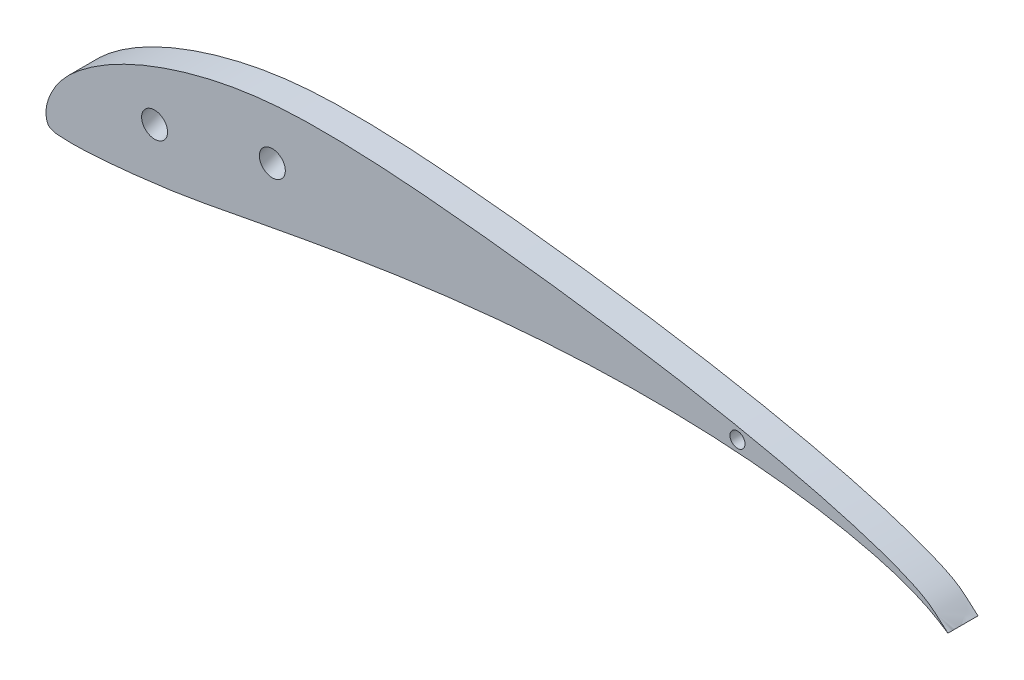
ISO-10303-21;
HEADER;
FILE_DESCRIPTION(('STEP AP214'),'2;1');
FILE_NAME('part.step','',(''),(''),'','','');
FILE_SCHEMA(('AUTOMOTIVE_DESIGN { 1 0 10303 214 1 1 1 1 }'));
ENDSEC;
DATA;
#1=APPLICATION_CONTEXT('core data for automotive mechanical design processes');
#2=APPLICATION_PROTOCOL_DEFINITION('international standard','automotive_design',2000,#1);
#3=PRODUCT_CONTEXT('',#1,'mechanical');
#4=PRODUCT('Part','Part','',(#3));
#5=PRODUCT_RELATED_PRODUCT_CATEGORY('part','',(#4));
#6=PRODUCT_DEFINITION_FORMATION('','',#4);
#7=PRODUCT_DEFINITION_CONTEXT('part definition',#1,'design');
#8=PRODUCT_DEFINITION('design','',#6,#7);
#9=PRODUCT_DEFINITION_SHAPE('','',#8);
#10=(LENGTH_UNIT() NAMED_UNIT(*) SI_UNIT(.MILLI.,.METRE.));
#11=(NAMED_UNIT(*) PLANE_ANGLE_UNIT() SI_UNIT($,.RADIAN.));
#12=(NAMED_UNIT(*) SI_UNIT($,.STERADIAN.) SOLID_ANGLE_UNIT());
#13=UNCERTAINTY_MEASURE_WITH_UNIT(LENGTH_MEASURE(1.E-05),#10,'distance_accuracy_value','');
#14=(GEOMETRIC_REPRESENTATION_CONTEXT(3) GLOBAL_UNCERTAINTY_ASSIGNED_CONTEXT((#13)) GLOBAL_UNIT_ASSIGNED_CONTEXT((#10,
#11,#12)) REPRESENTATION_CONTEXT('',''));
#15=CARTESIAN_POINT('',(0.,0.,0.));
#16=DIRECTION('',(0.,0.,1.));
#17=DIRECTION('',(1.,0.,0.));
#18=AXIS2_PLACEMENT_3D('',#15,#16,#17);
#19=CARTESIAN_POINT('',(0.900676601870566,3.33146790704091,75.));
#20=DIRECTION('',(0.,0.,-1.));
#21=DIRECTION('',(-1.,0.,0.));
#22=AXIS2_PLACEMENT_3D('',#19,#20,#21);
#23=PLANE('',#22);
#24=CARTESIAN_POINT('',(37.6424462791263,11.5072386040668,75.));
#25=DIRECTION('',(0.,0.,-1.));
#26=DIRECTION('',(-0.993803280370438,0.111153227235903,0.));
#27=AXIS2_PLACEMENT_3D('',#24,#25,#26);
#28=ELLIPSE('',#27,2.16077491266766,2.10000000000001);
#29=CARTESIAN_POINT('',(35.495061082775,11.7474157089401,75.));
#30=VERTEX_POINT('',#29);
#31=EDGE_CURVE('E67',#30,#30,#28,.T.);
#32=ORIENTED_EDGE('',*,*,#31,.T.);
#33=EDGE_LOOP('',(#32));
#34=FACE_BOUND('',#33,.T.);
#35=CARTESIAN_POINT('',(115.,10.3676422077244,75.));
#36=DIRECTION('',(0.,0.,-1.));
#37=DIRECTION('',(0.,1.,0.));
#38=AXIS2_PLACEMENT_3D('',#35,#36,#37);
#39=ELLIPSE('',#38,1.2502304023083,1.25);
#40=CARTESIAN_POINT('',(115.,11.6178726100327,75.));
#41=VERTEX_POINT('',#40);
#42=EDGE_CURVE('E71',#41,#41,#39,.T.);
#43=ORIENTED_EDGE('',*,*,#42,.T.);
#44=EDGE_LOOP('',(#43));
#45=FACE_BOUND('',#44,.T.);
#46=CARTESIAN_POINT('',(18.0612940095102,7.27979553568151,75.));
#47=DIRECTION('',(0.,0.,-1.));
#48=DIRECTION('',(-0.993803280370438,0.111153227235903,0.));
#49=AXIS2_PLACEMENT_3D('',#46,#47,#48);
#50=ELLIPSE('',#49,2.16077491266766,2.1);
#51=CARTESIAN_POINT('',(15.9139088131589,7.5199726405549,75.));
#52=VERTEX_POINT('',#51);
#53=EDGE_CURVE('E55',#52,#52,#50,.T.);
#54=ORIENTED_EDGE('',*,*,#53,.T.);
#55=EDGE_LOOP('',(#54));
#56=FACE_BOUND('',#55,.T.);
#57=CARTESIAN_POINT('',(150.,0.,75.));
#58=CARTESIAN_POINT('',(150.000899289152,0.00381819650752139,75.));
#59=CARTESIAN_POINT('',(149.507930169283,0.371377778407457,75.));
#60=CARTESIAN_POINT('',(149.091049020768,0.780692200444353,75.));
#61=CARTESIAN_POINT('',(148.165385918256,1.63564488717687,75.));
#62=CARTESIAN_POINT('',(147.073285762807,2.54518803078999,75.));
#63=CARTESIAN_POINT('',(145.579273929923,3.46224404255344,75.));
#64=CARTESIAN_POINT('',(143.721372273851,4.35111616153235,75.));
#65=CARTESIAN_POINT('',(141.478397693166,5.27886655467895,75.));
#66=CARTESIAN_POINT('',(138.853765182207,6.23258673383335,75.));
#67=CARTESIAN_POINT('',(135.85971864832,7.20554154204954,75.));
#68=CARTESIAN_POINT('',(132.511800063579,8.18928701155355,75.));
#69=CARTESIAN_POINT('',(128.828757145348,9.17920486900046,75.));
#70=CARTESIAN_POINT('',(124.830924819146,10.1662104195705,75.));
#71=CARTESIAN_POINT('',(120.54122319012,11.1431608499966,75.));
#72=CARTESIAN_POINT('',(115.985219841489,12.1039545564816,75.));
#73=CARTESIAN_POINT('',(111.190736161851,13.0436508102587,75.));
#74=CARTESIAN_POINT('',(106.185791668959,13.9506967600958,75.));
#75=CARTESIAN_POINT('',(101.001904956753,14.8237881075425,75.));
#76=CARTESIAN_POINT('',(95.6689490433944,15.6516948201271,75.));
#77=CARTESIAN_POINT('',(90.2214146874853,16.4360180876638,75.));
#78=CARTESIAN_POINT('',(84.6942136733632,17.1705453823488,75.));
#79=CARTESIAN_POINT('',(79.1273805633578,17.8529185629788,75.));
#80=CARTESIAN_POINT('',(73.5654214973004,18.4879403082002,75.));
#81=CARTESIAN_POINT('',(68.054377516833,19.0596198460297,75.));
#82=CARTESIAN_POINT('',(62.6391441800531,19.5572775987895,75.));
#83=CARTESIAN_POINT('',(57.35779940524,19.9529944989166,75.));
#84=CARTESIAN_POINT('',(52.2405056996451,20.2257080008233,75.));
#85=CARTESIAN_POINT('',(47.3157220885386,20.3444131036101,75.));
#86=CARTESIAN_POINT('',(42.6086861718548,20.3335787752035,75.));
#87=CARTESIAN_POINT('',(38.1281478975343,20.1046513112592,75.));
#88=CARTESIAN_POINT('',(33.8723652710563,19.6390793340002,75.));
#89=CARTESIAN_POINT('',(29.8240294835822,18.9800756122592,75.));
#90=CARTESIAN_POINT('',(25.982162907299,18.1258591702176,75.));
#91=CARTESIAN_POINT('',(22.3507285308284,17.1238704341562,75.));
#92=CARTESIAN_POINT('',(18.9450960578767,15.9918730111014,75.));
#93=CARTESIAN_POINT('',(15.7797567934298,14.7563611317165,75.));
#94=CARTESIAN_POINT('',(12.8743801617642,13.4239532815015,75.));
#95=CARTESIAN_POINT('',(10.238291416027,12.0217182709884,75.));
#96=CARTESIAN_POINT('',(7.88583461059793,10.5656076033478,75.));
#97=CARTESIAN_POINT('',(5.83176589681337,9.07535873582966,75.));
#98=CARTESIAN_POINT('',(4.0769434500407,7.5825739909971,75.));
#99=CARTESIAN_POINT('',(2.64680221041335,6.07094314969679,75.));
#100=CARTESIAN_POINT('',(1.54814866536494,4.55355888811498,75.));
#101=CARTESIAN_POINT('',(0.736478585984626,3.07725753828289,75.));
#102=CARTESIAN_POINT('',(0.216127101284425,1.67549317939585,75.));
#103=CARTESIAN_POINT('',(-0.032035919242502,0.381585183657673,75.));
#104=CARTESIAN_POINT('',(0.0154034725368893,-0.712842884515928,75.));
#105=CARTESIAN_POINT('',(0.296818428144351,-1.71669168240622,75.));
#106=CARTESIAN_POINT('',(1.34399590583567,-2.2153220143065,75.));
#107=CARTESIAN_POINT('',(2.75214635583259,-2.28571250716803,75.));
#108=CARTESIAN_POINT('',(4.67850051945847,-2.35412859107603,75.));
#109=CARTESIAN_POINT('',(7.10109213474685,-2.25049696083349,75.));
#110=CARTESIAN_POINT('',(9.99251237349676,-2.05951632249734,75.));
#111=CARTESIAN_POINT('',(13.3205931283223,-1.75315802660812,75.));
#112=CARTESIAN_POINT('',(17.0512775954276,-1.33837616882355,75.));
#113=CARTESIAN_POINT('',(21.1663777493917,-0.806236455276061,75.));
#114=CARTESIAN_POINT('',(25.6639152876827,-0.0620603139213689,75.));
#115=CARTESIAN_POINT('',(30.5657792465604,0.871378580307179,75.));
#116=CARTESIAN_POINT('',(35.8964372624993,1.88725938901887,75.));
#117=CARTESIAN_POINT('',(41.6298263636064,2.9598477369283,75.));
#118=CARTESIAN_POINT('',(47.7299218042866,4.04455437653433,75.));
#119=CARTESIAN_POINT('',(54.1519129709237,5.10060814991483,75.));
#120=CARTESIAN_POINT('',(60.8459682699352,6.09268798297526,75.));
#121=CARTESIAN_POINT('',(67.7543890329755,6.9843361398765,75.));
#122=CARTESIAN_POINT('',(74.8150435721905,7.74954211330217,75.));
#123=CARTESIAN_POINT('',(81.9612254877641,8.35386710869624,75.));
#124=CARTESIAN_POINT('',(89.1212177404963,8.78153799605541,75.));
#125=CARTESIAN_POINT('',(96.220212479205,9.01556347534524,75.));
#126=CARTESIAN_POINT('',(103.181194498136,9.04303469629456,75.));
#127=CARTESIAN_POINT('',(109.926502556761,8.86194901902542,75.));
#128=CARTESIAN_POINT('',(116.378899617892,8.47651792016937,75.));
#129=CARTESIAN_POINT('',(122.460796636297,7.89171254868704,75.));
#130=CARTESIAN_POINT('',(128.099790298758,7.12992514558223,75.));
#131=CARTESIAN_POINT('',(133.222466898318,6.21322885215876,75.));
#132=CARTESIAN_POINT('',(137.768772176685,5.17228657159243,75.));
#133=CARTESIAN_POINT('',(141.654931000593,4.05876887414132,75.));
#134=CARTESIAN_POINT('',(144.835255918468,2.87065969325588,75.));
#135=CARTESIAN_POINT('',(147.104253470448,1.78360851317507,75.));
#136=CARTESIAN_POINT('',(148.777054722266,0.778630866538671,75.));
#137=CARTESIAN_POINT('',(149.419672052869,0.38972272401338,75.));
#138=CARTESIAN_POINT('',(149.999082428381,-0.00389582009732438,75.));
#139=CARTESIAN_POINT('',(150.,0.,75.));
#140=B_SPLINE_CURVE_WITH_KNOTS('',3,(#57,#58,#59,#60,#61,#62,#63,#64,#65,#66,#67,#68,#69,#70,
#71,#72,#73,#74,#75,#76,#77,#78,#79,#80,#81,#82,#83,#84,#85,#86,#87,#88,#89,#90,#91,#92,#93,#94,
#95,#96,#97,#98,#99,#100,#101,#102,#103,#104,#105,#106,#107,#108,#109,#110,#111,#112,#113,#114,
#115,#116,#117,#118,#119,#120,#121,#122,#123,#124,#125,#126,#127,#128,#129,#130,#131,#132,#133,
#134,#135,#136,#137,#138,#139),.UNSPECIFIED.,.T.,.F.,(4,1,1,1,1,1,1,1,1,1,1,1,1,1,1,1,1,1,1,1,1,
1,1,1,1,1,1,1,1,1,1,1,1,1,1,1,1,1,1,1,1,1,1,1,1,1,1,1,1,1,1,1,1,1,1,1,1,1,1,1,1,1,1,1,1,1,1,1,1,
1,1,1,1,1,1,1,1,1,1,1,4),(0.,0.000979677557134127,0.0036488621677631,0.00748349851947815,
0.0120952771855933,0.0175255907768788,0.0240517799938711,0.0317830505527586,0.0406778280832618,
0.0507103007904779,0.0618332290621795,0.0739892504845854,0.0871181731906812,0.101145048769791,
0.115990637111827,0.131570421640589,0.147788379302961,0.164550916882416,0.181757895150531,
0.199311954944345,0.217095071712264,0.234990228463986,0.252856883122009,0.270540593729572,
0.287886779266045,0.304773437599674,0.321101419214061,0.336806063174811,0.351800032584037,
0.366031063392082,0.379615674919835,0.392652962879186,0.405170358707495,0.417171919049936,
0.428603516911185,0.439418959108259,0.449596586064162,0.459102079103161,0.467907877534646,
0.475988300736527,0.483308968746149,0.489874507816402,0.495803249719207,0.501149411695552,
0.50590307325604,0.510046768536663,0.513579310681042,0.516446926626751,0.5193500525909,
0.523823355179486,0.529973793997694,0.537715654387927,0.546967844488146,0.55763736682571,
0.569620481096633,0.582804124215616,0.597246960791632,0.613135036654701,0.630443600329816,
0.649056123608545,0.668822256795696,0.689594964002684,0.711189650864602,0.733426688964389,
0.756094117504156,0.778988553684861,0.801889682684955,0.824566597829707,0.846792284880412,
0.868338290507787,0.888978162959066,0.908492011340558,0.926658767581933,0.943286193042322,
0.958169210358795,0.971135821634751,0.981955623079976,0.990251791025976,0.995852565249962,
0.999000405686701,1.),.UNSPECIFIED.);
#141=CARTESIAN_POINT('',(150.,0.,75.));
#142=VERTEX_POINT('',#141);
#143=EDGE_CURVE('E10',#142,#142,#140,.T.);
#144=ORIENTED_EDGE('',*,*,#143,.T.);
#145=EDGE_LOOP('',(#144));
#146=FACE_BOUND('',#145,.T.);
#147=ADVANCED_FACE('F39',(#34,#45,#56,#146),#23,.F.);
#148=CARTESIAN_POINT('',(0.900676601870566,3.33146790704091,70.));
#149=DIRECTION('',(0.,0.,-1.));
#150=DIRECTION('',(-1.,0.,0.));
#151=AXIS2_PLACEMENT_3D('',#148,#149,#150);
#152=PLANE('',#151);
#153=CARTESIAN_POINT('',(36.4383600118256,11.6419112069093,70.));
#154=DIRECTION('',(0.,0.,-1.));
#155=DIRECTION('',(-0.993803280370438,0.111153227235903,0.));
#156=AXIS2_PLACEMENT_3D('',#153,#154,#155);
#157=ELLIPSE('',#156,2.16077491266766,2.10000000000001);
#158=CARTESIAN_POINT('',(34.2909748154744,11.8820883117827,70.));
#159=VERTEX_POINT('',#158);
#160=EDGE_CURVE('E58',#159,#159,#157,.T.);
#161=ORIENTED_EDGE('',*,*,#160,.F.);
#162=EDGE_LOOP('',(#161));
#163=FACE_BOUND('',#162,.T.);
#164=CARTESIAN_POINT('',(115.,10.4636471122631,70.));
#165=DIRECTION('',(0.,0.,-1.));
#166=DIRECTION('',(0.,1.,0.));
#167=AXIS2_PLACEMENT_3D('',#164,#165,#166);
#168=ELLIPSE('',#167,1.2502304023083,1.25);
#169=CARTESIAN_POINT('',(115.,11.7138775145714,70.));
#170=VERTEX_POINT('',#169);
#171=EDGE_CURVE('E68',#170,#170,#168,.T.);
#172=ORIENTED_EDGE('',*,*,#171,.F.);
#173=EDGE_LOOP('',(#172));
#174=FACE_BOUND('',#173,.T.);
#175=CARTESIAN_POINT('',(16.8572077422095,7.41446813852401,70.));
#176=DIRECTION('',(0.,0.,-1.));
#177=DIRECTION('',(-0.993803280370438,0.111153227235903,0.));
#178=AXIS2_PLACEMENT_3D('',#175,#176,#177);
#179=ELLIPSE('',#178,2.16077491266766,2.1);
#180=CARTESIAN_POINT('',(14.7098225458583,7.6546452433974,70.));
#181=VERTEX_POINT('',#180);
#182=EDGE_CURVE('E72',#181,#181,#179,.T.);
#183=ORIENTED_EDGE('',*,*,#182,.F.);
#184=EDGE_LOOP('',(#183));
#185=FACE_BOUND('',#184,.T.);
#186=CARTESIAN_POINT('',(150.,0.,70.));
#187=CARTESIAN_POINT('',(150.000899289152,0.00381819650752139,70.));
#188=CARTESIAN_POINT('',(149.507930169283,0.371377778407457,70.));
#189=CARTESIAN_POINT('',(149.091049020768,0.780692200444353,70.));
#190=CARTESIAN_POINT('',(148.165385918256,1.63564488717687,70.));
#191=CARTESIAN_POINT('',(147.073285762807,2.54518803078999,70.));
#192=CARTESIAN_POINT('',(145.579273929923,3.46224404255344,70.));
#193=CARTESIAN_POINT('',(143.721372273851,4.35111616153235,70.));
#194=CARTESIAN_POINT('',(141.478397693166,5.27886655467895,70.));
#195=CARTESIAN_POINT('',(138.853765182207,6.23258673383335,70.));
#196=CARTESIAN_POINT('',(135.85971864832,7.20554154204954,70.));
#197=CARTESIAN_POINT('',(132.511800063579,8.18928701155355,70.));
#198=CARTESIAN_POINT('',(128.828757145348,9.17920486900046,70.));
#199=CARTESIAN_POINT('',(124.830924819146,10.1662104195705,70.));
#200=CARTESIAN_POINT('',(120.54122319012,11.1431608499966,70.));
#201=CARTESIAN_POINT('',(115.985219841489,12.1039545564816,70.));
#202=CARTESIAN_POINT('',(111.190736161851,13.0436508102587,70.));
#203=CARTESIAN_POINT('',(106.185791668959,13.9506967600958,70.));
#204=CARTESIAN_POINT('',(101.001904956753,14.8237881075425,70.));
#205=CARTESIAN_POINT('',(95.6689490433944,15.6516948201271,70.));
#206=CARTESIAN_POINT('',(90.2214146874853,16.4360180876638,70.));
#207=CARTESIAN_POINT('',(84.6942136733632,17.1705453823488,70.));
#208=CARTESIAN_POINT('',(79.1273805633578,17.8529185629788,70.));
#209=CARTESIAN_POINT('',(73.5654214973004,18.4879403082002,70.));
#210=CARTESIAN_POINT('',(68.054377516833,19.0596198460297,70.));
#211=CARTESIAN_POINT('',(62.6391441800531,19.5572775987895,70.));
#212=CARTESIAN_POINT('',(57.35779940524,19.9529944989166,70.));
#213=CARTESIAN_POINT('',(52.2405056996451,20.2257080008233,70.));
#214=CARTESIAN_POINT('',(47.3157220885386,20.3444131036101,70.));
#215=CARTESIAN_POINT('',(42.6086861718548,20.3335787752035,70.));
#216=CARTESIAN_POINT('',(38.1281478975343,20.1046513112592,70.));
#217=CARTESIAN_POINT('',(33.8723652710563,19.6390793340002,70.));
#218=CARTESIAN_POINT('',(29.8240294835822,18.9800756122592,70.));
#219=CARTESIAN_POINT('',(25.982162907299,18.1258591702176,70.));
#220=CARTESIAN_POINT('',(22.3507285308284,17.1238704341562,70.));
#221=CARTESIAN_POINT('',(18.9450960578767,15.9918730111014,70.));
#222=CARTESIAN_POINT('',(15.7797567934298,14.7563611317165,70.));
#223=CARTESIAN_POINT('',(12.8743801617642,13.4239532815015,70.));
#224=CARTESIAN_POINT('',(10.238291416027,12.0217182709884,70.));
#225=CARTESIAN_POINT('',(7.88583461059793,10.5656076033478,70.));
#226=CARTESIAN_POINT('',(5.83176589681337,9.07535873582966,70.));
#227=CARTESIAN_POINT('',(4.0769434500407,7.5825739909971,70.));
#228=CARTESIAN_POINT('',(2.64680221041335,6.07094314969679,70.));
#229=CARTESIAN_POINT('',(1.54814866536494,4.55355888811498,70.));
#230=CARTESIAN_POINT('',(0.736478585984626,3.07725753828289,70.));
#231=CARTESIAN_POINT('',(0.216127101284425,1.67549317939585,70.));
#232=CARTESIAN_POINT('',(-0.032035919242502,0.381585183657673,70.));
#233=CARTESIAN_POINT('',(0.0154034725368893,-0.712842884515928,70.));
#234=CARTESIAN_POINT('',(0.296818428144351,-1.71669168240622,70.));
#235=CARTESIAN_POINT('',(1.34399590583567,-2.2153220143065,70.));
#236=CARTESIAN_POINT('',(2.75214635583259,-2.28571250716803,70.));
#237=CARTESIAN_POINT('',(4.67850051945847,-2.35412859107603,70.));
#238=CARTESIAN_POINT('',(7.10109213474685,-2.25049696083349,70.));
#239=CARTESIAN_POINT('',(9.99251237349676,-2.05951632249734,70.));
#240=CARTESIAN_POINT('',(13.3205931283223,-1.75315802660812,70.));
#241=CARTESIAN_POINT('',(17.0512775954276,-1.33837616882355,70.));
#242=CARTESIAN_POINT('',(21.1663777493917,-0.806236455276061,70.));
#243=CARTESIAN_POINT('',(25.6639152876827,-0.0620603139213689,70.));
#244=CARTESIAN_POINT('',(30.5657792465604,0.871378580307179,70.));
#245=CARTESIAN_POINT('',(35.8964372624993,1.88725938901887,70.));
#246=CARTESIAN_POINT('',(41.6298263636064,2.9598477369283,70.));
#247=CARTESIAN_POINT('',(47.7299218042866,4.04455437653433,70.));
#248=CARTESIAN_POINT('',(54.1519129709237,5.10060814991483,70.));
#249=CARTESIAN_POINT('',(60.8459682699352,6.09268798297526,70.));
#250=CARTESIAN_POINT('',(67.7543890329755,6.9843361398765,70.));
#251=CARTESIAN_POINT('',(74.8150435721905,7.74954211330217,70.));
#252=CARTESIAN_POINT('',(81.9612254877641,8.35386710869624,70.));
#253=CARTESIAN_POINT('',(89.1212177404963,8.78153799605541,70.));
#254=CARTESIAN_POINT('',(96.220212479205,9.01556347534524,70.));
#255=CARTESIAN_POINT('',(103.181194498136,9.04303469629456,70.));
#256=CARTESIAN_POINT('',(109.926502556761,8.86194901902542,70.));
#257=CARTESIAN_POINT('',(116.378899617892,8.47651792016937,70.));
#258=CARTESIAN_POINT('',(122.460796636297,7.89171254868704,70.));
#259=CARTESIAN_POINT('',(128.099790298758,7.12992514558223,70.));
#260=CARTESIAN_POINT('',(133.222466898318,6.21322885215876,70.));
#261=CARTESIAN_POINT('',(137.768772176685,5.17228657159243,70.));
#262=CARTESIAN_POINT('',(141.654931000593,4.05876887414132,70.));
#263=CARTESIAN_POINT('',(144.835255918468,2.87065969325588,70.));
#264=CARTESIAN_POINT('',(147.104253470448,1.78360851317507,70.));
#265=CARTESIAN_POINT('',(148.777054722266,0.778630866538671,70.));
#266=CARTESIAN_POINT('',(149.419672052869,0.38972272401338,70.));
#267=CARTESIAN_POINT('',(149.999082428381,-0.00389582009732438,70.));
#268=CARTESIAN_POINT('',(150.,0.,70.));
#269=B_SPLINE_CURVE_WITH_KNOTS('',3,(#186,#187,#188,#189,#190,#191,#192,#193,#194,#195,#196,
#197,#198,#199,#200,#201,#202,#203,#204,#205,#206,#207,#208,#209,#210,#211,#212,#213,#214,#215,
#216,#217,#218,#219,#220,#221,#222,#223,#224,#225,#226,#227,#228,#229,#230,#231,#232,#233,#234,
#235,#236,#237,#238,#239,#240,#241,#242,#243,#244,#245,#246,#247,#248,#249,#250,#251,#252,#253,
#254,#255,#256,#257,#258,#259,#260,#261,#262,#263,#264,#265,#266,#267,#268),.UNSPECIFIED.,.T.,
.F.,(4,1,1,1,1,1,1,1,1,1,1,1,1,1,1,1,1,1,1,1,1,1,1,1,1,1,1,1,1,1,1,1,1,1,1,1,1,1,1,1,1,1,1,1,1,
1,1,1,1,1,1,1,1,1,1,1,1,1,1,1,1,1,1,1,1,1,1,1,1,1,1,1,1,1,1,1,1,1,1,1,4),(0.,
0.000979677557134127,0.0036488621677631,0.00748349851947815,0.0120952771855933,
0.0175255907768788,0.0240517799938711,0.0317830505527586,0.0406778280832618,0.0507103007904779,
0.0618332290621795,0.0739892504845854,0.0871181731906812,0.101145048769791,0.115990637111827,
0.131570421640589,0.147788379302961,0.164550916882416,0.181757895150531,0.199311954944345,
0.217095071712264,0.234990228463986,0.252856883122009,0.270540593729572,0.287886779266045,
0.304773437599674,0.321101419214061,0.336806063174811,0.351800032584037,0.366031063392082,
0.379615674919835,0.392652962879186,0.405170358707495,0.417171919049936,0.428603516911185,
0.439418959108259,0.449596586064162,0.459102079103161,0.467907877534646,0.475988300736527,
0.483308968746149,0.489874507816402,0.495803249719207,0.501149411695552,0.50590307325604,
0.510046768536663,0.513579310681042,0.516446926626751,0.5193500525909,0.523823355179486,
0.529973793997694,0.537715654387927,0.546967844488146,0.55763736682571,0.569620481096633,
0.582804124215616,0.597246960791632,0.613135036654701,0.630443600329816,0.649056123608545,
0.668822256795696,0.689594964002684,0.711189650864602,0.733426688964389,0.756094117504156,
0.778988553684861,0.801889682684955,0.824566597829707,0.846792284880412,0.868338290507787,
0.888978162959066,0.908492011340558,0.926658767581933,0.943286193042322,0.958169210358795,
0.971135821634751,0.981955623079976,0.990251791025976,0.995852565249962,0.999000405686701,1.),.UNSPECIFIED.);
#270=CARTESIAN_POINT('',(150.,0.,70.));
#271=VERTEX_POINT('',#270);
#272=EDGE_CURVE('E49',#271,#271,#269,.T.);
#273=ORIENTED_EDGE('',*,*,#272,.F.);
#274=EDGE_LOOP('',(#273));
#275=FACE_BOUND('',#274,.T.);
#276=ADVANCED_FACE('F89',(#163,#174,#185,#275),#152,.T.);
#277=CARTESIAN_POINT('',(4.74743716557837E-05,0.0212217477680842,70.));
#278=CARTESIAN_POINT('',(2.43218950075959E-07,0.00151801072699147,75.));
#279=CARTESIAN_POINT('',(-0.00112273960208763,-0.240509349931553,70.));
#280=CARTESIAN_POINT('',(-8.36382857550691E-05,-0.260260989227729,75.));
#281=CARTESIAN_POINT('',(0.019819482796319,-0.509746820953582,70.));
#282=CARTESIAN_POINT('',(0.0220691312859094,-0.529626434632505,75.));
#283=CARTESIAN_POINT('',(0.119184676616905,-1.08050933216311,70.));
#284=CARTESIAN_POINT('',(0.124168787272293,-1.10082486014907,75.));
#285=CARTESIAN_POINT('',(0.207092317778644,-1.39662536668551,70.));
#286=CARTESIAN_POINT('',(0.215128171292299,-1.41516077802882,75.));
#287=CARTESIAN_POINT('',(0.579384512224486,-1.84820624477975,70.));
#288=CARTESIAN_POINT('',(0.596407747108545,-1.85934593608463,75.));
#289=CARTESIAN_POINT('',(0.880268400151804,-1.99451073350984,70.));
#290=CARTESIAN_POINT('',(0.899674660276473,-2.00262515254175,75.));
#291=CARTESIAN_POINT('',(1.63314221976803,-2.22808456724478,70.));
#292=CARTESIAN_POINT('',(1.65278345123915,-2.23075765721703,75.));
#293=CARTESIAN_POINT('',(2.10531268849063,-2.25337864636237,70.));
#294=CARTESIAN_POINT('',(2.12504806325617,-2.25432425958478,75.));
#295=CARTESIAN_POINT('',(3.20813448224813,-2.30185168554796,70.));
#296=CARTESIAN_POINT('',(3.22796887512608,-2.30261174305102,75.));
#297=CARTESIAN_POINT('',(3.85984142993748,-2.32505322683704,70.));
#298=CARTESIAN_POINT('',(3.87969883295583,-2.32552709888637,75.));
#299=CARTESIAN_POINT('',(5.30905967109101,-2.32686380730579,70.));
#300=CARTESIAN_POINT('',(5.32888983415117,-2.32630677226489,75.));
#301=CARTESIAN_POINT('',(6.12603475119775,-2.29220716308117,70.));
#302=CARTESIAN_POINT('',(6.14585283071528,-2.29128887606364,75.));
#303=CARTESIAN_POINT('',(7.897076903589,-2.1978372300651,70.));
#304=CARTESIAN_POINT('',(7.91687590840157,-2.1966137847566,75.));
#305=CARTESIAN_POINT('',(8.87072687478084,-2.13361115926643,70.));
#306=CARTESIAN_POINT('',(8.89051449006361,-2.13222411147324,75.));
#307=CARTESIAN_POINT('',(10.9444572798532,-1.97179494831067,70.));
#308=CARTESIAN_POINT('',(10.9642187073188,-1.97006828368312,75.));
#309=CARTESIAN_POINT('',(12.0640165377712,-1.86882909690212,70.));
#310=CARTESIAN_POINT('',(12.0837646316949,-1.86695167644748,75.));
#311=CARTESIAN_POINT('',(14.4181782599238,-1.63106024733171,70.));
#312=CARTESIAN_POINT('',(14.4379000155033,-1.62893454148985,75.));
#313=CARTESIAN_POINT('',(15.6722417726821,-1.49169898278795,70.));
#314=CARTESIAN_POINT('',(15.6919500979741,-1.48945086723688,75.));
#315=CARTESIAN_POINT('',(18.2830978903162,-1.17902194188272,70.));
#316=CARTESIAN_POINT('',(18.3027795094964,-1.1765395560706,75.));
#317=CARTESIAN_POINT('',(19.659331594069,-1.00111849444679,70.));
#318=CARTESIAN_POINT('',(19.6789899911428,-0.998463299623442,75.));
#319=CARTESIAN_POINT('',(22.5159340228966,-0.582810318429365,70.));
#320=CARTESIAN_POINT('',(22.535525103531,-0.579693199933605,75.));
#321=CARTESIAN_POINT('',(24.0152456534623,-0.334854169740744,70.));
#322=CARTESIAN_POINT('',(24.0348050702323,-0.331540266410314,75.));
#323=CARTESIAN_POINT('',(27.137005063211,0.218538894069538,70.));
#324=CARTESIAN_POINT('',(27.1565062632083,0.222166764067372,75.));
#325=CARTESIAN_POINT('',(28.7783192773168,0.531000986974172,70.));
#326=CARTESIAN_POINT('',(28.7978049931779,0.534712021920137,75.));
#327=CARTESIAN_POINT('',(32.1875173057283,1.18043897150666,70.));
#328=CARTESIAN_POINT('',(32.2070024236022,1.18415181081348,75.));
#329=CARTESIAN_POINT('',(33.974894993898,1.5210648389345,70.));
#330=CARTESIAN_POINT('',(33.9943819925571,1.52476755234728,75.));
#331=CARTESIAN_POINT('',(37.6654788356257,2.21819553627208,70.));
#332=CARTESIAN_POINT('',(37.6849742459291,2.22185449400859,75.));
#333=CARTESIAN_POINT('',(39.5882653969388,2.57791752675444,70.));
#334=CARTESIAN_POINT('',(39.6077682160076,2.58153673350815,75.));
#335=CARTESIAN_POINT('',(43.5362634662411,3.29881543523057,70.));
#336=CARTESIAN_POINT('',(43.5557876972618,3.30231828784932,75.));
#337=CARTESIAN_POINT('',(45.5811874470931,3.66247077691486,70.));
#338=CARTESIAN_POINT('',(45.6007243522082,3.66590210595217,75.));
#339=CARTESIAN_POINT('',(49.7598663880073,4.37832052398629,70.));
#340=CARTESIAN_POINT('',(49.7794324150101,4.38158277752034,75.));
#341=CARTESIAN_POINT('',(51.9134068843971,4.73250069880329,70.));
#342=CARTESIAN_POINT('',(51.932988420593,4.73566851237646,75.));
#343=CARTESIAN_POINT('',(56.2912253154964,5.41760673325003,70.));
#344=CARTESIAN_POINT('',(56.3108393927093,5.42056776608816,75.));
#345=CARTESIAN_POINT('',(58.5353136827066,5.7502417803727,70.));
#346=CARTESIAN_POINT('',(58.5549445521347,5.75308912804966,75.));
#347=CARTESIAN_POINT('',(63.0762758945049,6.38048309827859,70.));
#348=CARTESIAN_POINT('',(63.0959409678148,6.38308488813707,75.));
#349=CARTESIAN_POINT('',(65.3929720461025,6.67955547056852,70.));
#350=CARTESIAN_POINT('',(65.4126537887238,6.68202818177056,75.));
#351=CARTESIAN_POINT('',(70.0570395809351,7.23381966587949,70.));
#352=CARTESIAN_POINT('',(70.0767533189189,7.2360248486505,75.));
#353=CARTESIAN_POINT('',(72.4242171054296,7.49043374259394,70.));
#354=CARTESIAN_POINT('',(72.4439464821597,7.49249366602081,75.));
#355=CARTESIAN_POINT('',(77.1679041294983,7.94843557094162,70.));
#356=CARTESIAN_POINT('',(77.187663648563,7.95018542656586,75.));
#357=CARTESIAN_POINT('',(79.5642117073992,8.15116091413076,70.));
#358=CARTESIAN_POINT('',(79.5839847559303,8.15275086262461,75.));
#359=CARTESIAN_POINT('',(84.3420423675224,8.49599275531487,70.));
#360=CARTESIAN_POINT('',(84.3618390214406,8.49725728062864,75.));
#361=CARTESIAN_POINT('',(86.743349825568,8.63950643438546,70.));
#362=CARTESIAN_POINT('',(86.7631565958988,8.64060037919165,75.));
#363=CARTESIAN_POINT('',(91.50573285764,8.86005778276219,70.));
#364=CARTESIAN_POINT('',(91.525556236114,8.86079942524676,75.));
#365=CARTESIAN_POINT('',(93.886592198654,8.9386333430184,70.));
#366=CARTESIAN_POINT('',(93.9064215866892,8.93918985373245,75.));
#367=CARTESIAN_POINT('',(98.5825628060966,9.02479118734688,70.));
#368=CARTESIAN_POINT('',(98.6023995321108,9.0249646757355,75.));
#369=CARTESIAN_POINT('',(100.917478562586,9.03410103715525,70.));
#370=CARTESIAN_POINT('',(100.93731597522,9.03407567156421,75.));
#371=CARTESIAN_POINT('',(105.495490608155,8.98080418655828,70.));
#372=CARTESIAN_POINT('',(105.515323560821,8.98037227398911,75.));
#373=CARTESIAN_POINT('',(107.758443173884,8.92015310671063,70.));
#374=CARTESIAN_POINT('',(107.778270348389,8.91950961025333,75.));
#375=CARTESIAN_POINT('',(112.166520378994,8.72803584356576,70.));
#376=CARTESIAN_POINT('',(112.186329324868,8.72695926154402,75.));
#377=CARTESIAN_POINT('',(114.331590573824,8.59881302493079,70.));
#378=CARTESIAN_POINT('',(114.351385493185,8.59750696782519,75.));
#379=CARTESIAN_POINT('',(118.518134656754,8.2707023550595,70.));
#380=CARTESIAN_POINT('',(118.537892601677,8.26891974971542,75.));
#381=CARTESIAN_POINT('',(120.559710289388,8.07451168256909,70.));
#382=CARTESIAN_POINT('',(120.579444429723,8.07248154567679,75.));
#383=CARTESIAN_POINT('',(124.473865285723,7.61963747204167,70.));
#384=CARTESIAN_POINT('',(124.493542637793,7.61710321405346,75.));
#385=CARTESIAN_POINT('',(126.366751735266,7.3640461653578,70.));
#386=CARTESIAN_POINT('',(126.38639170462,7.36124337544054,75.));
#387=CARTESIAN_POINT('',(129.96009246219,6.79688861046591,70.));
#388=CARTESIAN_POINT('',(129.979642421403,6.79352806106568,75.));
#389=CARTESIAN_POINT('',(131.681231543166,6.48903090795955,70.));
#390=CARTESIAN_POINT('',(131.700729701386,6.48537079566455,75.));
#391=CARTESIAN_POINT('',(134.909138316615,5.82688663340589,70.));
#392=CARTESIAN_POINT('',(134.928522774193,5.82260270950678,75.));
#393=CARTESIAN_POINT('',(136.436913270557,5.47723491145318,70.));
#394=CARTESIAN_POINT('',(136.456212440797,5.47262008515733,75.));
#395=CARTESIAN_POINT('',(139.251731046066,4.74719423331289,70.));
#396=CARTESIAN_POINT('',(139.270813564085,4.74190023306091,75.));
#397=CARTESIAN_POINT('',(140.561230315296,4.37215160603077,70.));
#398=CARTESIAN_POINT('',(140.580214746998,4.36641353842299,75.));
#399=CARTESIAN_POINT('',(142.927747913038,3.58301591792542,70.));
#400=CARTESIAN_POINT('',(142.946560143737,3.57624067878499,75.));
#401=CARTESIAN_POINT('',(144.006604721327,3.1802280928685,70.));
#402=CARTESIAN_POINT('',(144.025114053223,3.17296527594395,75.));
#403=CARTESIAN_POINT('',(145.816721760686,2.40016174763412,70.));
#404=CARTESIAN_POINT('',(145.834308816422,2.39202469837214,75.));
#405=CARTESIAN_POINT('',(146.58430737447,2.03270883358698,70.));
#406=CARTESIAN_POINT('',(146.601932904546,2.02381116929534,75.));
#407=CARTESIAN_POINT('',(147.906224894408,1.30151650415205,70.));
#408=CARTESIAN_POINT('',(147.924647409842,1.29073611148914,75.));
#409=CARTESIAN_POINT('',(148.461925584482,0.967952663693584,70.));
#410=CARTESIAN_POINT('',(148.479194496374,0.957566023990856,75.));
#411=CARTESIAN_POINT('',(149.137197461517,0.56066460008055,70.));
#412=CARTESIAN_POINT('',(149.150427929324,0.552667647823261,75.));
#413=CARTESIAN_POINT('',(149.349615892021,0.432120291104139,70.));
#414=CARTESIAN_POINT('',(149.365705728599,0.421876558480458,75.));
#415=CARTESIAN_POINT('',(149.842991556696,0.102064400592599,70.));
#416=CARTESIAN_POINT('',(149.868254616503,0.0849811745454894,75.));
#417=CARTESIAN_POINT('',(149.990263602918,0.00209518970493609,70.));
#418=CARTESIAN_POINT('',(150.007405941045,-0.00924692993429299,75.));
#419=CARTESIAN_POINT('',(150.008816460412,-0.00239274122793016,70.));
#420=CARTESIAN_POINT('',(149.992370913954,0.0101769843010658,75.));
#421=CARTESIAN_POINT('',(149.877071121162,0.0961449322391688,70.));
#422=CARTESIAN_POINT('',(149.852918329683,0.114390763543264,75.));
#423=CARTESIAN_POINT('',(149.464141506951,0.415880339845763,70.));
#424=CARTESIAN_POINT('',(149.449839038889,0.428414508294238,75.));
#425=CARTESIAN_POINT('',(149.308180538242,0.567501793784408,70.));
#426=CARTESIAN_POINT('',(149.296899889218,0.578449074613866,75.));
#427=CARTESIAN_POINT('',(148.878240582451,0.9771216951931,70.));
#428=CARTESIAN_POINT('',(148.863513068381,0.990846924440424,75.));
#429=CARTESIAN_POINT('',(148.554693407981,1.2760761808063,70.));
#430=CARTESIAN_POINT('',(148.53905621053,1.29031076731651,75.));
#431=CARTESIAN_POINT('',(147.873695417601,1.87831188357688,70.));
#432=CARTESIAN_POINT('',(147.858631616233,1.89112170474412,75.));
#433=CARTESIAN_POINT('',(147.505620049167,2.18512335728402,70.));
#434=CARTESIAN_POINT('',(147.490378971826,2.19723634063155,75.));
#435=CARTESIAN_POINT('',(146.668416020911,2.793110406897,70.));
#436=CARTESIAN_POINT('',(146.65173558688,2.80394443056235,75.));
#437=CARTESIAN_POINT('',(146.173452270119,3.09752483019978,70.));
#438=CARTESIAN_POINT('',(146.156253975643,3.10771093932195,75.));
#439=CARTESIAN_POINT('',(145.078592601998,3.70135926379378,70.));
#440=CARTESIAN_POINT('',(145.060867445771,3.71026420473721,75.));
#441=CARTESIAN_POINT('',(144.456916149872,3.99921139760471,70.));
#442=CARTESIAN_POINT('',(144.438971784858,4.0076133247128,75.));
#443=CARTESIAN_POINT('',(143.101263496418,4.60739762325484,70.));
#444=CARTESIAN_POINT('',(143.083003507956,4.61516145149312,75.));
#445=CARTESIAN_POINT('',(142.346233845258,4.91990781380706,70.));
#446=CARTESIAN_POINT('',(142.327840606885,4.92736930256842,75.));
#447=CARTESIAN_POINT('',(140.729601095307,5.55079332390628,70.));
#448=CARTESIAN_POINT('',(140.711009841666,5.55771446049363,75.));
#449=CARTESIAN_POINT('',(139.847715115635,5.87141232003577,70.));
#450=CARTESIAN_POINT('',(139.82903502787,5.87808582271422,75.));
#451=CARTESIAN_POINT('',(137.980074126072,6.51637680864895,70.));
#452=CARTESIAN_POINT('',(137.961245420056,6.52262277174545,75.));
#453=CARTESIAN_POINT('',(136.974239986987,6.84336317139224,70.));
#454=CARTESIAN_POINT('',(136.955345343132,6.84940900016865,75.));
#455=CARTESIAN_POINT('',(134.864078473324,7.49799488059283,70.));
#456=CARTESIAN_POINT('',(134.845074480002,7.50368248498958,75.));
#457=CARTESIAN_POINT('',(133.739868567956,7.82843390331864,70.));
#458=CARTESIAN_POINT('',(133.72081564968,7.83395547394536,75.));
#459=CARTESIAN_POINT('',(131.399347588318,8.48820538510887,70.));
#460=CARTESIAN_POINT('',(131.380211948477,8.49343206424061,75.));
#461=CARTESIAN_POINT('',(130.163272899682,8.82051749945627,70.));
#462=CARTESIAN_POINT('',(130.144099175705,8.82560304313582,75.));
#463=CARTESIAN_POINT('',(127.605366857732,9.48116886195693,70.));
#464=CARTESIAN_POINT('',(127.586125782323,9.48599213583512,75.));
#465=CARTESIAN_POINT('',(126.263813496153,9.81245144166507,70.));
#466=CARTESIAN_POINT('',(126.244541407456,9.81714948273394,75.));
#467=CARTESIAN_POINT('',(123.502916661109,10.4685915050954,70.));
#468=CARTESIAN_POINT('',(123.483589534959,10.4730568857463,75.));
#469=CARTESIAN_POINT('',(122.063885623392,10.7963848156185,70.));
#470=CARTESIAN_POINT('',(122.044533104926,10.8007389938694,75.));
#471=CARTESIAN_POINT('',(119.116507533003,11.4435561837941,70.));
#472=CARTESIAN_POINT('',(119.097109701728,11.4477030210453,75.));
#473=CARTESIAN_POINT('',(117.588494196237,11.7658477132825,70.));
#474=CARTESIAN_POINT('',(117.569075414625,11.7698955043913,75.));
#475=CARTESIAN_POINT('',(114.472204487185,12.4004489205718,70.));
#476=CARTESIAN_POINT('',(114.452748128324,12.4043118053751,75.));
#477=CARTESIAN_POINT('',(112.864274180393,12.715645228916,70.));
#478=CARTESIAN_POINT('',(112.844799561246,12.7194149034793,75.));
#479=CARTESIAN_POINT('',(109.597983552103,13.3322562656283,70.));
#480=CARTESIAN_POINT('',(109.578474119769,13.3358410148499,75.));
#481=CARTESIAN_POINT('',(107.919956084657,13.6364141917587,70.));
#482=CARTESIAN_POINT('',(107.900430747387,13.6399115488247,75.));
#483=CARTESIAN_POINT('',(104.523664818382,14.2305964391417,70.));
#484=CARTESIAN_POINT('',(104.50411127805,14.2339322318541,75.));
#485=CARTESIAN_POINT('',(102.785741730872,14.5233470409827,70.));
#486=CARTESIAN_POINT('',(102.766174269226,14.5266000163613,75.));
#487=CARTESIAN_POINT('',(99.2799565468954,15.0910657039681,70.));
#488=CARTESIAN_POINT('',(99.2603620283589,15.0941513177577,75.));
#489=CARTESIAN_POINT('',(97.4924186048122,15.3686130330997,70.));
#490=CARTESIAN_POINT('',(97.4728118576367,15.3716202223627,75.));
#491=CARTESIAN_POINT('',(93.8980929646453,15.9066212349424,70.));
#492=CARTESIAN_POINT('',(93.8784647680927,15.9094845623348,75.));
#493=CARTESIAN_POINT('',(92.0716303312258,16.1696283626,70.));
#494=CARTESIAN_POINT('',(92.051991770946,16.1724196561489,75.));
#495=CARTESIAN_POINT('',(88.4118515340825,16.6764600453036,70.));
#496=CARTESIAN_POINT('',(88.3921932777386,16.6791091295941,75.));
#497=CARTESIAN_POINT('',(86.5588517431416,16.9227477079994,70.));
#498=CARTESIAN_POINT('',(86.5391842733833,16.92532751957,75.));
#499=CARTESIAN_POINT('',(82.8585019156152,17.3955298589742,70.));
#500=CARTESIAN_POINT('',(82.8388175585744,17.3979767644574,75.));
#501=CARTESIAN_POINT('',(80.9914617489535,17.6244225792782,70.));
#502=CARTESIAN_POINT('',(80.9717698954973,17.6268086436226,75.));
#503=CARTESIAN_POINT('',(77.2782059868205,18.0640154468874,70.));
#504=CARTESIAN_POINT('',(77.2585012564957,18.0662928408109,75.));
#505=CARTESIAN_POINT('',(75.4122960644931,18.2770783624479,70.));
#506=CARTESIAN_POINT('',(75.3925843596878,18.2792942679902,75.));
#507=CARTESIAN_POINT('',(71.7171281695314,18.6796358956177,70.));
#508=CARTESIAN_POINT('',(71.6974016570581,18.6817164280626,75.));
#509=CARTESIAN_POINT('',(69.8681721159992,18.8714686968384,70.));
#510=CARTESIAN_POINT('',(69.8484380259414,18.8734763067432,75.));
#511=CARTESIAN_POINT('',(66.2230167856434,19.2278824769539,70.));
#512=CARTESIAN_POINT('',(66.2032674256957,19.2297361144848,75.));
#513=CARTESIAN_POINT('',(64.4071165497376,19.3948016533002,70.));
#514=CARTESIAN_POINT('',(64.3873586120335,19.3965604865021,75.));
#515=CARTESIAN_POINT('',(60.8404265611366,19.6919953199023,70.));
#516=CARTESIAN_POINT('',(60.8206498736699,19.6935324657795,75.));
#517=CARTESIAN_POINT('',(59.0699369440651,19.8247086572714,70.));
#518=CARTESIAN_POINT('',(59.0501507223533,19.8261182814392,75.));
#519=CARTESIAN_POINT('',(55.6045407245487,20.0463596818626,70.));
#520=CARTESIAN_POINT('',(55.5847353984646,20.0474855565363,75.));
#521=CARTESIAN_POINT('',(53.8899228696936,20.1378063953209,70.));
#522=CARTESIAN_POINT('',(53.8701090579017,20.1387635860799,75.));
#523=CARTESIAN_POINT('',(50.5438021900408,20.2665098172807,70.));
#524=CARTESIAN_POINT('',(50.5239737001119,20.2670826323872,75.));
#525=CARTESIAN_POINT('',(48.8925518313556,20.3064058018728,70.));
#526=CARTESIAN_POINT('',(48.872718385173,20.3067941659748,75.));
#527=CARTESIAN_POINT('',(45.6836567794205,20.3405709116245,70.));
#528=CARTESIAN_POINT('',(45.6638181396986,20.3406108658123,75.));
#529=CARTESIAN_POINT('',(44.1062076375039,20.3370256661221,70.));
#530=CARTESIAN_POINT('',(44.0863710591413,20.3368139234621,75.));
#531=CARTESIAN_POINT('',(41.0526046272317,20.2539149237947,70.));
#532=CARTESIAN_POINT('',(41.032780977279,20.2530598827127,75.));
#533=CARTESIAN_POINT('',(39.5565469206512,20.1776335615698,70.));
#534=CARTESIAN_POINT('',(39.5367422929354,20.1764246418161,75.));
#535=CARTESIAN_POINT('',(36.6588222207857,19.9437217567741,70.));
#536=CARTESIAN_POINT('',(36.6390791539186,19.9417509142966,75.));
#537=CARTESIAN_POINT('',(35.2370779393735,19.7883754872919,70.));
#538=CARTESIAN_POINT('',(35.2173739308378,19.7860412201187,75.));
#539=CARTESIAN_POINT('',(32.480335487954,19.4123065968078,70.));
#540=CARTESIAN_POINT('',(32.4607245831562,19.4092870153972,75.));
#541=CARTESIAN_POINT('',(31.1252837305871,19.1918988000394,70.));
#542=CARTESIAN_POINT('',(31.1057326049097,19.1885190248939,75.));
#543=CARTESIAN_POINT('',(28.5033129007978,18.6862305976031,70.));
#544=CARTESIAN_POINT('',(28.4839050560756,18.6821068260904,75.));
#545=CARTESIAN_POINT('',(27.2163361832538,18.4002703408598,70.));
#546=CARTESIAN_POINT('',(27.1970052960403,18.395796944587,75.));
#547=CARTESIAN_POINT('',(24.7305494883191,17.7803425991723,70.));
#548=CARTESIAN_POINT('',(24.711380343887,17.7752236685072,75.));
#549=CARTESIAN_POINT('',(23.5118325602191,17.4442433331911,70.));
#550=CARTESIAN_POINT('',(23.4927544455815,17.4387967862203,75.));
#551=CARTESIAN_POINT('',(21.1699132303119,16.7312028726039,70.));
#552=CARTESIAN_POINT('',(21.1510332145406,16.7251039738072,75.));
#553=CARTESIAN_POINT('',(20.0268454603067,16.351435455278,70.));
#554=CARTESIAN_POINT('',(20.0080734342278,16.345011358256,75.));
#555=CARTESIAN_POINT('',(17.8415090823096,15.5609373059268,70.));
#556=CARTESIAN_POINT('',(17.8229658349154,15.5538772372336,75.));
#557=CARTESIAN_POINT('',(16.7794727031947,15.1465755066488,70.));
#558=CARTESIAN_POINT('',(16.7610627031634,15.1391768597259,75.));
#559=CARTESIAN_POINT('',(14.7615477483182,14.2892044747337,70.));
#560=CARTESIAN_POINT('',(14.7434346271337,14.2811030275949,75.));
#561=CARTESIAN_POINT('',(13.7859129806613,13.8419828995517,70.));
#562=CARTESIAN_POINT('',(13.7679622296964,13.8335278033388,75.));
#563=CARTESIAN_POINT('',(11.9444069550611,12.9290510732127,70.));
#564=CARTESIAN_POINT('',(11.9268000679755,12.9198996964602,75.));
#565=CARTESIAN_POINT('',(11.0589357771153,12.4582499530719,70.));
#566=CARTESIAN_POINT('',(11.0415247008615,12.4487324328419,75.));
#567=CARTESIAN_POINT('',(9.40236529954459,11.5040551281394,70.));
#568=CARTESIAN_POINT('',(9.38538125804222,11.4937886712973,75.));
#569=CARTESIAN_POINT('',(8.61171947757166,11.0149117928403,70.));
#570=CARTESIAN_POINT('',(8.59498115926332,11.0042514812625,75.));
#571=CARTESIAN_POINT('',(7.14946441052461,10.0310740382646,70.));
#572=CARTESIAN_POINT('',(7.1332646106687,10.0196100022957,75.));
#573=CARTESIAN_POINT('',(6.45831557854274,9.5299272453323,70.));
#574=CARTESIAN_POINT('',(6.4424119726452,9.51805526078613,75.));
#575=CARTESIAN_POINT('',(5.19649062706024,8.53462409259356,70.));
#576=CARTESIAN_POINT('',(5.18121177568516,8.52194817882762,75.));
#577=CARTESIAN_POINT('',(4.60647979810383,8.03303767390518,70.));
#578=CARTESIAN_POINT('',(4.59161015354861,8.01988863120959,75.));
#579=CARTESIAN_POINT('',(3.55791972395115,7.03347961651996,70.));
#580=CARTESIAN_POINT('',(3.54401916907806,7.01928362717904,75.));
#581=CARTESIAN_POINT('',(3.07926441450604,6.52804709669825,70.));
#582=CARTESIAN_POINT('',(3.06595096793146,6.51330651849834,75.));
#583=CARTESIAN_POINT('',(2.25057740736171,5.52299661400936,70.));
#584=CARTESIAN_POINT('',(2.23859453733948,5.50715495516461,75.));
#585=CARTESIAN_POINT('',(1.88126442672049,5.01363532972286,70.));
#586=CARTESIAN_POINT('',(1.86996934020131,4.99729175718577,75.));
#587=CARTESIAN_POINT('',(1.25464789649079,4.0189103914598,70.));
#588=CARTESIAN_POINT('',(1.24472666445949,4.00168156642357,75.));
#589=CARTESIAN_POINT('',(0.980395726126377,3.52090479396758,70.));
#590=CARTESIAN_POINT('',(0.971282835429486,3.50324909059857,75.));
#591=CARTESIAN_POINT('',(0.546206814856154,2.56335424785157,70.));
#592=CARTESIAN_POINT('',(0.538863744746753,2.544906907259,75.));
#593=CARTESIAN_POINT('',(0.36981281669036,2.08950402525751,70.));
#594=CARTESIAN_POINT('',(0.36346061439833,2.07067253773405,75.));
#595=CARTESIAN_POINT('',(0.124235298451449,1.19362668228937,70.));
#596=CARTESIAN_POINT('',(0.119959916089567,1.17408289841582,75.));
#597=CARTESIAN_POINT('',(0.0397516082351512,0.75588130400785,70.));
#598=CARTESIAN_POINT('',(0.0368170455963577,0.736178257046802,75.));
#599=CARTESIAN_POINT('',(0.00427317214516059,0.226075765594933,70.));
#600=CARTESIAN_POINT('',(0.00338958859705788,0.20639775942344,75.));
#601=CARTESIAN_POINT('',(0.000491063422068458,0.120435269138583,70.));
#602=CARTESIAN_POINT('',(3.20398970399072E-05,0.100749690243199,75.));
#603=CARTESIAN_POINT('',(4.74743716557837E-05,0.0212217477680842,70.));
#604=CARTESIAN_POINT('',(2.43218950075959E-07,0.00151801072699147,75.));
#605=B_SPLINE_SURFACE_WITH_KNOTS('',3,1,((#277,#278),(#279,#280),(#281,#282),(#283,#284),(#285,
#286),(#287,#288),(#289,#290),(#291,#292),(#293,#294),(#295,#296),(#297,#298),(#299,#300),(#301,
#302),(#303,#304),(#305,#306),(#307,#308),(#309,#310),(#311,#312),(#313,#314),(#315,#316),(#317,
#318),(#319,#320),(#321,#322),(#323,#324),(#325,#326),(#327,#328),(#329,#330),(#331,#332),(#333,
#334),(#335,#336),(#337,#338),(#339,#340),(#341,#342),(#343,#344),(#345,#346),(#347,#348),(#349,
#350),(#351,#352),(#353,#354),(#355,#356),(#357,#358),(#359,#360),(#361,#362),(#363,#364),(#365,
#366),(#367,#368),(#369,#370),(#371,#372),(#373,#374),(#375,#376),(#377,#378),(#379,#380),(#381,
#382),(#383,#384),(#385,#386),(#387,#388),(#389,#390),(#391,#392),(#393,#394),(#395,#396),(#397,
#398),(#399,#400),(#401,#402),(#403,#404),(#405,#406),(#407,#408),(#409,#410),(#411,#412),(#413,
#414),(#415,#416),(#417,#418),(#419,#420),(#421,#422),(#423,#424),(#425,#426),(#427,#428),(#429,
#430),(#431,#432),(#433,#434),(#435,#436),(#437,#438),(#439,#440),(#441,#442),(#443,#444),(#445,
#446),(#447,#448),(#449,#450),(#451,#452),(#453,#454),(#455,#456),(#457,#458),(#459,#460),(#461,
#462),(#463,#464),(#465,#466),(#467,#468),(#469,#470),(#471,#472),(#473,#474),(#475,#476),(#477,
#478),(#479,#480),(#481,#482),(#483,#484),(#485,#486),(#487,#488),(#489,#490),(#491,#492),(#493,
#494),(#495,#496),(#497,#498),(#499,#500),(#501,#502),(#503,#504),(#505,#506),(#507,#508),(#509,
#510),(#511,#512),(#513,#514),(#515,#516),(#517,#518),(#519,#520),(#521,#522),(#523,#524),(#525,
#526),(#527,#528),(#529,#530),(#531,#532),(#533,#534),(#535,#536),(#537,#538),(#539,#540),(#541,
#542),(#543,#544),(#545,#546),(#547,#548),(#549,#550),(#551,#552),(#553,#554),(#555,#556),(#557,
#558),(#559,#560),(#561,#562),(#563,#564),(#565,#566),(#567,#568),(#569,#570),(#571,#572),(#573,
#574),(#575,#576),(#577,#578),(#579,#580),(#581,#582),(#583,#584),(#585,#586),(#587,#588),(#589,
#590),(#591,#592),(#593,#594),(#595,#596),(#597,#598),(#599,#600),(#601,#602),(#603,#604)),
.UNSPECIFIED.,.T.,.F.,.F.,(4,1,1,1,1,1,1,1,1,1,1,1,1,1,1,1,1,1,1,1,1,1,1,1,1,1,1,1,1,1,1,1,1,1,
1,1,1,1,1,1,1,1,1,1,1,1,1,1,1,1,1,1,1,1,1,1,1,1,1,1,1,1,1,1,1,1,1,1,1,1,1,1,1,1,1,1,1,1,1,1,1,1,
1,1,1,1,1,1,1,1,1,1,1,1,1,1,1,1,1,1,1,1,1,1,1,1,1,1,1,1,1,1,1,1,1,1,1,1,1,1,1,1,1,1,1,1,1,1,1,1,
1,1,1,1,1,1,1,1,1,1,1,1,1,1,1,1,1,1,1,1,1,1,1,1,1,1,1,1,1,1,1,4),(2,2),(0.,0.00251577169672612,
0.00257889708198411,0.00538338764243507,0.00544651302769306,0.00828651360658428,
0.00834963899184227,0.0127598161951699,0.0128229415804278,0.0189102550133776,0.0189733803986356,
0.0266521154036112,0.0267152407888692,0.0359043055038302,0.0359674308890882,0.0465738278413942,
0.0466369532266522,0.0585569421123169,0.0586200674975749,0.0717405852312998,0.0718037106165578,
0.0861834218073163,0.0862465471925743,0.102071497670385,0.102134623055643,0.1193800613455,
0.119443186730758,0.137992584624229,0.138055710009487,0.15775871781138,0.157821843196638,
0.178531425018368,0.178594550403626,0.200126111880286,0.200189237265544,0.222363149980073,
0.222426275365331,0.24503057851984,0.245093703905098,0.267925014700545,0.267988140085803,
0.290826143700639,0.290889269085897,0.313503058845391,0.313566184230649,0.335728745896096,
0.335791871281354,0.357274751523471,0.357337876908729,0.37791462397475,0.377977749360008,
0.397428472356242,0.3974915977415,0.415595228597617,0.415658353982875,0.432222654058006,
0.432285779443264,0.447105671374479,0.447168796759737,0.460072282650435,0.460135408035693,
0.47089208409566,0.470955209480918,0.47918825204166,0.479251377426918,0.484789026265646,
0.484852151650904,0.487936866702385,0.487999992087643,0.488936461015684,0.488999586400942,
0.489916138572818,0.489979263958076,0.492585323183447,0.492648448568705,0.496419959535162,
0.49648308492042,0.501031738201277,0.501094863586535,0.506462051792563,0.506525177177821,
0.512988241009555,0.513051366394813,0.520719511568443,0.520782636953701,0.529614289098946,
0.529677414484204,0.539646761806162,0.53970988719142,0.550769690077863,0.550832815463121,
0.562925711500269,0.562988836885527,0.576054634206365,0.576117759591623,0.590081509785475,
0.590144635170733,0.604927098127511,0.604990223512769,0.620506882656273,0.620570008041531,
0.636724840318645,0.636787965703903,0.6534873778981,0.653550503283358,0.670694356166215,
0.670757481551473,0.688248415960029,0.688311541345287,0.706031532727948,0.706094658113206,
0.72392668947967,0.723989814864928,0.741793344137693,0.741856469522951,0.759477054745256,
0.759540180130514,0.776823240281729,0.776886365666987,0.793709898615358,0.793773024000616,
0.810037880229745,0.810101005615003,0.825742524190495,0.825805649575753,0.840736493599721,
0.840799618984979,0.854967524407766,0.855030649793024,0.868552135935519,0.868615261320777,
0.88158942389487,0.881652549280128,0.894106819723179,0.894169945108437,0.90610838006562,
0.906171505450878,0.917539977926869,0.917603103312127,0.928355420123943,0.928418545509201,
0.938533047079846,0.938596172465104,0.948038540118845,0.948101665504103,0.95684433855033,
0.956907463935588,0.964924761752211,0.964987887137469,0.972245429761833,0.972308555147091,
0.978810968832086,0.978874094217344,0.984739710734891,0.984802836120149,0.990085872711236,
0.990148998096494,0.994839534271724,0.994902659656982,0.998983229552347,0.999046354937605,1.),
(0.,1.),.UNSPECIFIED.);
#606=ORIENTED_EDGE('',*,*,#272,.T.);
#607=EDGE_LOOP('',(#606));
#608=FACE_BOUND('',#607,.T.);
#609=ORIENTED_EDGE('',*,*,#143,.F.);
#610=EDGE_LOOP('',(#609));
#611=FACE_BOUND('',#610,.T.);
#612=ADVANCED_FACE('F98',(#608,#611),#605,.T.);
#613=CARTESIAN_POINT('',(94.3839665236835,-1.2566135593429,391.931911719554));
#614=DIRECTION('',(-0.234043920679335,0.0261769483078732,-0.971873556883987));
#615=DIRECTION('',(-0.97220670784136,0.,0.234124149177877));
#616=AXIS2_PLACEMENT_3D('',#613,#614,#615);
#617=CYLINDRICAL_SURFACE('',#616,2.1);
#618=ORIENTED_EDGE('',*,*,#182,.T.);
#619=EDGE_LOOP('',(#618));
#620=FACE_BOUND('',#619,.T.);
#621=ORIENTED_EDGE('',*,*,#53,.F.);
#622=EDGE_LOOP('',(#621));
#623=FACE_BOUND('',#622,.T.);
#624=ADVANCED_FACE('F100',(#620,#623),#617,.F.);
#625=CARTESIAN_POINT('',(115.,4.46059007107428,382.643248281866));
#626=DIRECTION('',(0.,0.0191974423996897,-0.999815712121644));
#627=DIRECTION('',(0.,0.999815712121644,0.0191974423996897));
#628=AXIS2_PLACEMENT_3D('',#625,#626,#627);
#629=CYLINDRICAL_SURFACE('',#628,1.25);
#630=ORIENTED_EDGE('',*,*,#171,.T.);
#631=EDGE_LOOP('',(#630));
#632=FACE_BOUND('',#631,.T.);
#633=ORIENTED_EDGE('',*,*,#42,.F.);
#634=EDGE_LOOP('',(#633));
#635=FACE_BOUND('',#634,.T.);
#636=ADVANCED_FACE('F143',(#632,#635),#629,.F.);
#637=CARTESIAN_POINT('',(113.854606041436,2.98318995226389,391.473004601081));
#638=DIRECTION('',(-0.234043920679335,0.0261769483078732,-0.971873556883987));
#639=DIRECTION('',(-0.97220670784136,0.,0.234124149177877));
#640=AXIS2_PLACEMENT_3D('',#637,#638,#639);
#641=CYLINDRICAL_SURFACE('',#640,2.10000000000001);
#642=ORIENTED_EDGE('',*,*,#160,.T.);
#643=EDGE_LOOP('',(#642));
#644=FACE_BOUND('',#643,.T.);
#645=ORIENTED_EDGE('',*,*,#31,.F.);
#646=EDGE_LOOP('',(#645));
#647=FACE_BOUND('',#646,.T.);
#648=ADVANCED_FACE('F141',(#644,#647),#641,.F.);
#649=CLOSED_SHELL('',(#147,#276,#612,#624,#636,#648));
#650=MANIFOLD_SOLID_BREP('B2',#649);
#651=ADVANCED_BREP_SHAPE_REPRESENTATION('',(#18,#650),#14);
#652=SHAPE_DEFINITION_REPRESENTATION(#9,#651);
ENDSEC;
END-ISO-10303-21;
